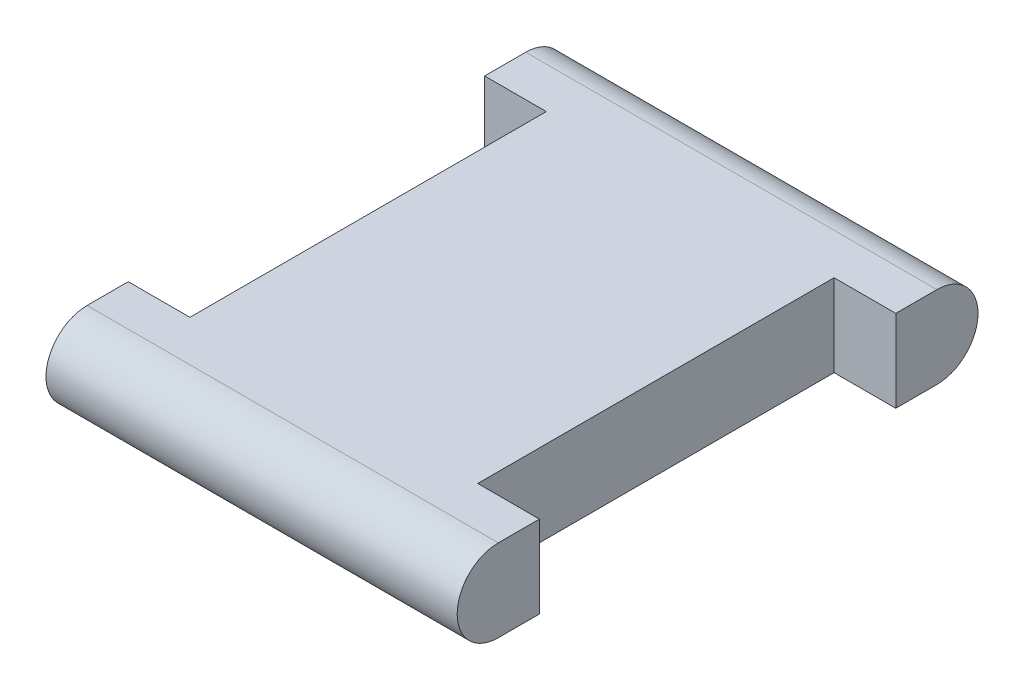
ISO-10303-21;
HEADER;
FILE_DESCRIPTION(('STEP AP214'),'2;1');
FILE_NAME('part.step','',(''),(''),'','','');
FILE_SCHEMA(('AUTOMOTIVE_DESIGN { 1 0 10303 214 1 1 1 1 }'));
ENDSEC;
DATA;
#1=APPLICATION_CONTEXT('core data for automotive mechanical design processes');
#2=APPLICATION_PROTOCOL_DEFINITION('international standard','automotive_design',2000,#1);
#3=PRODUCT_CONTEXT('',#1,'mechanical');
#4=PRODUCT('Part','Part','',(#3));
#5=PRODUCT_RELATED_PRODUCT_CATEGORY('part','',(#4));
#6=PRODUCT_DEFINITION_FORMATION('','',#4);
#7=PRODUCT_DEFINITION_CONTEXT('part definition',#1,'design');
#8=PRODUCT_DEFINITION('design','',#6,#7);
#9=PRODUCT_DEFINITION_SHAPE('','',#8);
#10=(LENGTH_UNIT() NAMED_UNIT(*) SI_UNIT(.MILLI.,.METRE.));
#11=(NAMED_UNIT(*) PLANE_ANGLE_UNIT() SI_UNIT($,.RADIAN.));
#12=(NAMED_UNIT(*) SI_UNIT($,.STERADIAN.) SOLID_ANGLE_UNIT());
#13=UNCERTAINTY_MEASURE_WITH_UNIT(LENGTH_MEASURE(1.E-05),#10,'distance_accuracy_value','');
#14=(GEOMETRIC_REPRESENTATION_CONTEXT(3) GLOBAL_UNCERTAINTY_ASSIGNED_CONTEXT((#13)) GLOBAL_UNIT_ASSIGNED_CONTEXT((#10,
#11,#12)) REPRESENTATION_CONTEXT('',''));
#15=CARTESIAN_POINT('',(0.,0.,0.));
#16=DIRECTION('',(0.,0.,1.));
#17=DIRECTION('',(1.,0.,0.));
#18=AXIS2_PLACEMENT_3D('',#15,#16,#17);
#19=CARTESIAN_POINT('',(75.,0.,80.));
#20=DIRECTION('',(1.,0.,0.));
#21=DIRECTION('',(0.,0.,-1.));
#22=AXIS2_PLACEMENT_3D('',#19,#20,#21);
#23=PLANE('',#22);
#24=DIRECTION('',(0.,0.,-1.));
#25=VECTOR('',#24,1.);
#26=CARTESIAN_POINT('',(75.,-15.,80.));
#27=LINE('',#26,#25);
#28=CARTESIAN_POINT('',(75.,-15.,80.));
#29=VERTEX_POINT('',#28);
#30=CARTESIAN_POINT('',(75.,-15.,65.));
#31=VERTEX_POINT('',#30);
#32=EDGE_CURVE('E224',#29,#31,#27,.T.);
#33=ORIENTED_EDGE('',*,*,#32,.T.);
#34=DIRECTION('',(0.,1.,0.));
#35=VECTOR('',#34,1.);
#36=CARTESIAN_POINT('',(75.,-15.,65.));
#37=LINE('',#36,#35);
#38=CARTESIAN_POINT('',(75.,15.,65.));
#39=VERTEX_POINT('',#38);
#40=EDGE_CURVE('E237',#31,#39,#37,.T.);
#41=ORIENTED_EDGE('',*,*,#40,.T.);
#42=DIRECTION('',(0.,0.,1.));
#43=VECTOR('',#42,1.);
#44=CARTESIAN_POINT('',(75.,15.,80.));
#45=LINE('',#44,#43);
#46=CARTESIAN_POINT('',(75.,15.,80.));
#47=VERTEX_POINT('',#46);
#48=EDGE_CURVE('E229',#39,#47,#45,.T.);
#49=ORIENTED_EDGE('',*,*,#48,.T.);
#50=CARTESIAN_POINT('',(75.,0.,80.));
#51=DIRECTION('',(1.,0.,0.));
#52=DIRECTION('',(0.,0.,-1.));
#53=AXIS2_PLACEMENT_3D('',#50,#51,#52);
#54=CIRCLE('',#53,15.);
#55=EDGE_CURVE('E207',#47,#29,#54,.T.);
#56=ORIENTED_EDGE('',*,*,#55,.T.);
#57=EDGE_LOOP('',(#33,#41,#49,#56));
#58=FACE_BOUND('',#57,.T.);
#59=ADVANCED_FACE('F82',(#58),#23,.T.);
#60=CARTESIAN_POINT('',(-75.,0.,80.));
#61=DIRECTION('',(1.,0.,0.));
#62=DIRECTION('',(0.,0.,-1.));
#63=AXIS2_PLACEMENT_3D('',#60,#61,#62);
#64=PLANE('',#63);
#65=DIRECTION('',(0.,1.,0.));
#66=VECTOR('',#65,1.);
#67=CARTESIAN_POINT('',(-75.,-15.,-65.));
#68=LINE('',#67,#66);
#69=CARTESIAN_POINT('',(-75.,-15.,-65.));
#70=VERTEX_POINT('',#69);
#71=CARTESIAN_POINT('',(-75.,15.,-65.));
#72=VERTEX_POINT('',#71);
#73=EDGE_CURVE('E169',#70,#72,#68,.T.);
#74=ORIENTED_EDGE('',*,*,#73,.T.);
#75=DIRECTION('',(0.,0.,1.));
#76=VECTOR('',#75,1.);
#77=CARTESIAN_POINT('',(-75.,15.,80.));
#78=LINE('',#77,#76);
#79=CARTESIAN_POINT('',(-75.,15.,-80.));
#80=VERTEX_POINT('',#79);
#81=EDGE_CURVE('E205',#80,#72,#78,.T.);
#82=ORIENTED_EDGE('',*,*,#81,.F.);
#83=CARTESIAN_POINT('',(-75.,0.,-80.));
#84=DIRECTION('',(1.,0.,0.));
#85=DIRECTION('',(0.,0.,1.));
#86=AXIS2_PLACEMENT_3D('',#83,#84,#85);
#87=CIRCLE('',#86,15.);
#88=CARTESIAN_POINT('',(-75.,-15.,-80.));
#89=VERTEX_POINT('',#88);
#90=EDGE_CURVE('E194',#89,#80,#87,.T.);
#91=ORIENTED_EDGE('',*,*,#90,.F.);
#92=DIRECTION('',(0.,0.,-1.));
#93=VECTOR('',#92,1.);
#94=CARTESIAN_POINT('',(-75.,-15.,80.));
#95=LINE('',#94,#93);
#96=EDGE_CURVE('E185',#70,#89,#95,.T.);
#97=ORIENTED_EDGE('',*,*,#96,.F.);
#98=EDGE_LOOP('',(#74,#82,#91,#97));
#99=FACE_BOUND('',#98,.T.);
#100=ADVANCED_FACE('F193',(#99),#64,.F.);
#101=CARTESIAN_POINT('',(75.,0.,80.));
#102=DIRECTION('',(-1.,0.,0.));
#103=DIRECTION('',(0.,0.,1.));
#104=AXIS2_PLACEMENT_3D('',#101,#102,#103);
#105=CYLINDRICAL_SURFACE('',#104,15.);
#106=DIRECTION('',(-1.,0.,0.));
#107=VECTOR('',#106,1.);
#108=CARTESIAN_POINT('',(75.,-15.,80.));
#109=LINE('',#108,#107);
#110=CARTESIAN_POINT('',(-75.,-15.,80.));
#111=VERTEX_POINT('',#110);
#112=EDGE_CURVE('E13',#29,#111,#109,.T.);
#113=ORIENTED_EDGE('',*,*,#112,.F.);
#114=ORIENTED_EDGE('',*,*,#55,.F.);
#115=DIRECTION('',(-1.,0.,0.));
#116=VECTOR('',#115,1.);
#117=CARTESIAN_POINT('',(75.,15.,80.));
#118=LINE('',#117,#116);
#119=CARTESIAN_POINT('',(-75.,15.,80.));
#120=VERTEX_POINT('',#119);
#121=EDGE_CURVE('E208',#47,#120,#118,.T.);
#122=ORIENTED_EDGE('',*,*,#121,.T.);
#123=CARTESIAN_POINT('',(-75.,0.,80.));
#124=DIRECTION('',(1.,0.,0.));
#125=DIRECTION('',(0.,0.,-1.));
#126=AXIS2_PLACEMENT_3D('',#123,#124,#125);
#127=CIRCLE('',#126,15.);
#128=EDGE_CURVE('E196',#120,#111,#127,.T.);
#129=ORIENTED_EDGE('',*,*,#128,.T.);
#130=EDGE_LOOP('',(#113,#114,#122,#129));
#131=FACE_BOUND('',#130,.T.);
#132=ADVANCED_FACE('F84',(#131),#105,.T.);
#133=CARTESIAN_POINT('',(75.,-15.,80.));
#134=DIRECTION('',(0.,1.,0.));
#135=DIRECTION('',(0.,0.,1.));
#136=AXIS2_PLACEMENT_3D('',#133,#134,#135);
#137=PLANE('',#136);
#138=CARTESIAN_POINT('',(75.,-15.,-65.));
#139=VERTEX_POINT('',#138);
#140=CARTESIAN_POINT('',(75.,-15.,-80.));
#141=VERTEX_POINT('',#140);
#142=EDGE_CURVE('E220',#139,#141,#27,.T.);
#143=ORIENTED_EDGE('',*,*,#142,.F.);
#144=DIRECTION('',(-1.,0.,0.));
#145=VECTOR('',#144,1.);
#146=CARTESIAN_POINT('',(0.,-15.,-65.));
#147=LINE('',#146,#145);
#148=CARTESIAN_POINT('',(52.5,-15.,-65.));
#149=VERTEX_POINT('',#148);
#150=EDGE_CURVE('E179',#139,#149,#147,.T.);
#151=ORIENTED_EDGE('',*,*,#150,.T.);
#152=DIRECTION('',(0.,0.,1.));
#153=VECTOR('',#152,1.);
#154=CARTESIAN_POINT('',(52.5,-15.,0.));
#155=LINE('',#154,#153);
#156=CARTESIAN_POINT('',(52.5,-15.,65.));
#157=VERTEX_POINT('',#156);
#158=EDGE_CURVE('E251',#149,#157,#155,.T.);
#159=ORIENTED_EDGE('',*,*,#158,.T.);
#160=DIRECTION('',(-1.,0.,0.));
#161=VECTOR('',#160,1.);
#162=CARTESIAN_POINT('',(0.,-15.,65.));
#163=LINE('',#162,#161);
#164=EDGE_CURVE('E249',#31,#157,#163,.T.);
#165=ORIENTED_EDGE('',*,*,#164,.F.);
#166=ORIENTED_EDGE('',*,*,#32,.F.);
#167=ORIENTED_EDGE('',*,*,#112,.T.);
#168=CARTESIAN_POINT('',(-75.,-15.,65.));
#169=VERTEX_POINT('',#168);
#170=EDGE_CURVE('E195',#111,#169,#95,.T.);
#171=ORIENTED_EDGE('',*,*,#170,.T.);
#172=DIRECTION('',(1.,0.,0.));
#173=VECTOR('',#172,1.);
#174=CARTESIAN_POINT('',(0.,-15.,65.));
#175=LINE('',#174,#173);
#176=CARTESIAN_POINT('',(-52.5,-15.,65.));
#177=VERTEX_POINT('',#176);
#178=EDGE_CURVE('E252',#169,#177,#175,.T.);
#179=ORIENTED_EDGE('',*,*,#178,.T.);
#180=DIRECTION('',(0.,0.,1.));
#181=VECTOR('',#180,1.);
#182=CARTESIAN_POINT('',(-52.5,-15.,0.));
#183=LINE('',#182,#181);
#184=CARTESIAN_POINT('',(-52.5,-15.,-65.));
#185=VERTEX_POINT('',#184);
#186=EDGE_CURVE('E189',#185,#177,#183,.T.);
#187=ORIENTED_EDGE('',*,*,#186,.F.);
#188=DIRECTION('',(1.,0.,0.));
#189=VECTOR('',#188,1.);
#190=CARTESIAN_POINT('',(0.,-15.,-65.));
#191=LINE('',#190,#189);
#192=EDGE_CURVE('E172',#70,#185,#191,.T.);
#193=ORIENTED_EDGE('',*,*,#192,.F.);
#194=ORIENTED_EDGE('',*,*,#96,.T.);
#195=DIRECTION('',(-1.,0.,0.));
#196=VECTOR('',#195,1.);
#197=CARTESIAN_POINT('',(75.,-15.,-80.));
#198=LINE('',#197,#196);
#199=EDGE_CURVE('E90',#141,#89,#198,.T.);
#200=ORIENTED_EDGE('',*,*,#199,.F.);
#201=EDGE_LOOP('',(#143,#151,#159,#165,#166,#167,#171,#179,#187,#193,#194,#200));
#202=FACE_BOUND('',#201,.T.);
#203=ADVANCED_FACE('F183',(#202),#137,.F.);
#204=CARTESIAN_POINT('',(75.,0.,-80.));
#205=DIRECTION('',(-1.,0.,0.));
#206=DIRECTION('',(0.,0.,1.));
#207=AXIS2_PLACEMENT_3D('',#204,#205,#206);
#208=CYLINDRICAL_SURFACE('',#207,15.);
#209=DIRECTION('',(-1.,0.,0.));
#210=VECTOR('',#209,1.);
#211=CARTESIAN_POINT('',(75.,15.,-80.));
#212=LINE('',#211,#210);
#213=CARTESIAN_POINT('',(75.,15.,-80.));
#214=VERTEX_POINT('',#213);
#215=EDGE_CURVE('E211',#214,#80,#212,.T.);
#216=ORIENTED_EDGE('',*,*,#215,.F.);
#217=CARTESIAN_POINT('',(75.,0.,-80.));
#218=DIRECTION('',(1.,0.,0.));
#219=DIRECTION('',(0.,0.,1.));
#220=AXIS2_PLACEMENT_3D('',#217,#218,#219);
#221=CIRCLE('',#220,15.);
#222=EDGE_CURVE('E218',#141,#214,#221,.T.);
#223=ORIENTED_EDGE('',*,*,#222,.F.);
#224=ORIENTED_EDGE('',*,*,#199,.T.);
#225=ORIENTED_EDGE('',*,*,#90,.T.);
#226=EDGE_LOOP('',(#216,#223,#224,#225));
#227=FACE_BOUND('',#226,.T.);
#228=ADVANCED_FACE('F217',(#227),#208,.T.);
#229=CARTESIAN_POINT('',(75.,15.,80.));
#230=DIRECTION('',(0.,-1.,0.));
#231=DIRECTION('',(0.,0.,-1.));
#232=AXIS2_PLACEMENT_3D('',#229,#230,#231);
#233=PLANE('',#232);
#234=DIRECTION('',(0.,0.,1.));
#235=VECTOR('',#234,1.);
#236=CARTESIAN_POINT('',(52.5,15.,0.));
#237=LINE('',#236,#235);
#238=CARTESIAN_POINT('',(52.5,15.,-65.));
#239=VERTEX_POINT('',#238);
#240=CARTESIAN_POINT('',(52.5,15.,65.));
#241=VERTEX_POINT('',#240);
#242=EDGE_CURVE('E267',#239,#241,#237,.T.);
#243=ORIENTED_EDGE('',*,*,#242,.F.);
#244=DIRECTION('',(-1.,0.,0.));
#245=VECTOR('',#244,1.);
#246=CARTESIAN_POINT('',(0.,15.,-65.));
#247=LINE('',#246,#245);
#248=CARTESIAN_POINT('',(75.,15.,-65.));
#249=VERTEX_POINT('',#248);
#250=EDGE_CURVE('E190',#249,#239,#247,.T.);
#251=ORIENTED_EDGE('',*,*,#250,.F.);
#252=EDGE_CURVE('E212',#214,#249,#45,.T.);
#253=ORIENTED_EDGE('',*,*,#252,.F.);
#254=ORIENTED_EDGE('',*,*,#215,.T.);
#255=ORIENTED_EDGE('',*,*,#81,.T.);
#256=DIRECTION('',(1.,0.,0.));
#257=VECTOR('',#256,1.);
#258=CARTESIAN_POINT('',(0.,15.,-65.));
#259=LINE('',#258,#257);
#260=CARTESIAN_POINT('',(-52.5,15.,-65.));
#261=VERTEX_POINT('',#260);
#262=EDGE_CURVE('E105',#72,#261,#259,.T.);
#263=ORIENTED_EDGE('',*,*,#262,.T.);
#264=DIRECTION('',(0.,0.,1.));
#265=VECTOR('',#264,1.);
#266=CARTESIAN_POINT('',(-52.5,15.,0.));
#267=LINE('',#266,#265);
#268=CARTESIAN_POINT('',(-52.5,15.,65.));
#269=VERTEX_POINT('',#268);
#270=EDGE_CURVE('E260',#261,#269,#267,.T.);
#271=ORIENTED_EDGE('',*,*,#270,.T.);
#272=DIRECTION('',(1.,0.,0.));
#273=VECTOR('',#272,1.);
#274=CARTESIAN_POINT('',(0.,15.,65.));
#275=LINE('',#274,#273);
#276=CARTESIAN_POINT('',(-75.,15.,65.));
#277=VERTEX_POINT('',#276);
#278=EDGE_CURVE('E263',#277,#269,#275,.T.);
#279=ORIENTED_EDGE('',*,*,#278,.F.);
#280=EDGE_CURVE('E204',#277,#120,#78,.T.);
#281=ORIENTED_EDGE('',*,*,#280,.T.);
#282=ORIENTED_EDGE('',*,*,#121,.F.);
#283=ORIENTED_EDGE('',*,*,#48,.F.);
#284=DIRECTION('',(-1.,0.,0.));
#285=VECTOR('',#284,1.);
#286=CARTESIAN_POINT('',(0.,15.,65.));
#287=LINE('',#286,#285);
#288=EDGE_CURVE('E97',#39,#241,#287,.T.);
#289=ORIENTED_EDGE('',*,*,#288,.T.);
#290=EDGE_LOOP('',(#243,#251,#253,#254,#255,#263,#271,#279,#281,#282,#283,#289));
#291=FACE_BOUND('',#290,.T.);
#292=ADVANCED_FACE('F240',(#291),#233,.F.);
#293=DIRECTION('',(0.,1.,0.));
#294=VECTOR('',#293,1.);
#295=CARTESIAN_POINT('',(75.,-15.,-65.));
#296=LINE('',#295,#294);
#297=EDGE_CURVE('E199',#139,#249,#296,.T.);
#298=ORIENTED_EDGE('',*,*,#297,.F.);
#299=ORIENTED_EDGE('',*,*,#142,.T.);
#300=ORIENTED_EDGE('',*,*,#222,.T.);
#301=ORIENTED_EDGE('',*,*,#252,.T.);
#302=EDGE_LOOP('',(#298,#299,#300,#301));
#303=FACE_BOUND('',#302,.T.);
#304=ADVANCED_FACE('F288',(#303),#23,.T.);
#305=ORIENTED_EDGE('',*,*,#280,.F.);
#306=DIRECTION('',(0.,1.,0.));
#307=VECTOR('',#306,1.);
#308=CARTESIAN_POINT('',(-75.,-15.,65.));
#309=LINE('',#308,#307);
#310=EDGE_CURVE('E278',#169,#277,#309,.T.);
#311=ORIENTED_EDGE('',*,*,#310,.F.);
#312=ORIENTED_EDGE('',*,*,#170,.F.);
#313=ORIENTED_EDGE('',*,*,#128,.F.);
#314=EDGE_LOOP('',(#305,#311,#312,#313));
#315=FACE_BOUND('',#314,.T.);
#316=ADVANCED_FACE('F290',(#315),#64,.F.);
#317=CARTESIAN_POINT('',(0.,-15.,-65.));
#318=DIRECTION('',(0.,0.,1.));
#319=DIRECTION('',(1.,0.,0.));
#320=AXIS2_PLACEMENT_3D('',#317,#318,#319);
#321=PLANE('',#320);
#322=ORIENTED_EDGE('',*,*,#262,.F.);
#323=ORIENTED_EDGE('',*,*,#73,.F.);
#324=ORIENTED_EDGE('',*,*,#192,.T.);
#325=DIRECTION('',(0.,1.,0.));
#326=VECTOR('',#325,1.);
#327=CARTESIAN_POINT('',(-52.5,-15.,-65.));
#328=LINE('',#327,#326);
#329=EDGE_CURVE('E178',#185,#261,#328,.T.);
#330=ORIENTED_EDGE('',*,*,#329,.T.);
#331=EDGE_LOOP('',(#322,#323,#324,#330));
#332=FACE_BOUND('',#331,.T.);
#333=ADVANCED_FACE('F171',(#332),#321,.T.);
#334=CARTESIAN_POINT('',(0.,-15.,65.));
#335=DIRECTION('',(0.,0.,1.));
#336=DIRECTION('',(1.,0.,0.));
#337=AXIS2_PLACEMENT_3D('',#334,#335,#336);
#338=PLANE('',#337);
#339=ORIENTED_EDGE('',*,*,#278,.T.);
#340=DIRECTION('',(0.,1.,0.));
#341=VECTOR('',#340,1.);
#342=CARTESIAN_POINT('',(-52.5,-15.,65.));
#343=LINE('',#342,#341);
#344=EDGE_CURVE('E280',#177,#269,#343,.T.);
#345=ORIENTED_EDGE('',*,*,#344,.F.);
#346=ORIENTED_EDGE('',*,*,#178,.F.);
#347=ORIENTED_EDGE('',*,*,#310,.T.);
#348=EDGE_LOOP('',(#339,#345,#346,#347));
#349=FACE_BOUND('',#348,.T.);
#350=ADVANCED_FACE('F342',(#349),#338,.F.);
#351=CARTESIAN_POINT('',(-52.5,-15.,0.));
#352=DIRECTION('',(-1.,0.,0.));
#353=DIRECTION('',(0.,0.,1.));
#354=AXIS2_PLACEMENT_3D('',#351,#352,#353);
#355=PLANE('',#354);
#356=ORIENTED_EDGE('',*,*,#270,.F.);
#357=ORIENTED_EDGE('',*,*,#329,.F.);
#358=ORIENTED_EDGE('',*,*,#186,.T.);
#359=ORIENTED_EDGE('',*,*,#344,.T.);
#360=EDGE_LOOP('',(#356,#357,#358,#359));
#361=FACE_BOUND('',#360,.T.);
#362=ADVANCED_FACE('F284',(#361),#355,.T.);
#363=CARTESIAN_POINT('',(0.,-15.,-65.));
#364=DIRECTION('',(0.,0.,-1.));
#365=DIRECTION('',(-1.,0.,0.));
#366=AXIS2_PLACEMENT_3D('',#363,#364,#365);
#367=PLANE('',#366);
#368=ORIENTED_EDGE('',*,*,#250,.T.);
#369=DIRECTION('',(0.,1.,0.));
#370=VECTOR('',#369,1.);
#371=CARTESIAN_POINT('',(52.5,-15.,-65.));
#372=LINE('',#371,#370);
#373=EDGE_CURVE('E273',#149,#239,#372,.T.);
#374=ORIENTED_EDGE('',*,*,#373,.F.);
#375=ORIENTED_EDGE('',*,*,#150,.F.);
#376=ORIENTED_EDGE('',*,*,#297,.T.);
#377=EDGE_LOOP('',(#368,#374,#375,#376));
#378=FACE_BOUND('',#377,.T.);
#379=ADVANCED_FACE('F287',(#378),#367,.F.);
#380=CARTESIAN_POINT('',(52.5,-15.,0.));
#381=DIRECTION('',(-1.,0.,0.));
#382=DIRECTION('',(0.,0.,1.));
#383=AXIS2_PLACEMENT_3D('',#380,#381,#382);
#384=PLANE('',#383);
#385=ORIENTED_EDGE('',*,*,#242,.T.);
#386=DIRECTION('',(0.,1.,0.));
#387=VECTOR('',#386,1.);
#388=CARTESIAN_POINT('',(52.5,-15.,65.));
#389=LINE('',#388,#387);
#390=EDGE_CURVE('E275',#157,#241,#389,.T.);
#391=ORIENTED_EDGE('',*,*,#390,.F.);
#392=ORIENTED_EDGE('',*,*,#158,.F.);
#393=ORIENTED_EDGE('',*,*,#373,.T.);
#394=EDGE_LOOP('',(#385,#391,#392,#393));
#395=FACE_BOUND('',#394,.T.);
#396=ADVANCED_FACE('F368',(#395),#384,.F.);
#397=CARTESIAN_POINT('',(0.,-15.,65.));
#398=DIRECTION('',(0.,0.,-1.));
#399=DIRECTION('',(-1.,0.,0.));
#400=AXIS2_PLACEMENT_3D('',#397,#398,#399);
#401=PLANE('',#400);
#402=ORIENTED_EDGE('',*,*,#288,.F.);
#403=ORIENTED_EDGE('',*,*,#40,.F.);
#404=ORIENTED_EDGE('',*,*,#164,.T.);
#405=ORIENTED_EDGE('',*,*,#390,.T.);
#406=EDGE_LOOP('',(#402,#403,#404,#405));
#407=FACE_BOUND('',#406,.T.);
#408=ADVANCED_FACE('F377',(#407),#401,.T.);
#409=CLOSED_SHELL('',(#59,#100,#132,#203,#228,#292,#304,#316,#333,#350,#362,#379,#396,#408));
#410=MANIFOLD_SOLID_BREP('B2',#409);
#411=ADVANCED_BREP_SHAPE_REPRESENTATION('',(#18,#410),#14);
#412=SHAPE_DEFINITION_REPRESENTATION(#9,#411);
ENDSEC;
END-ISO-10303-21;
